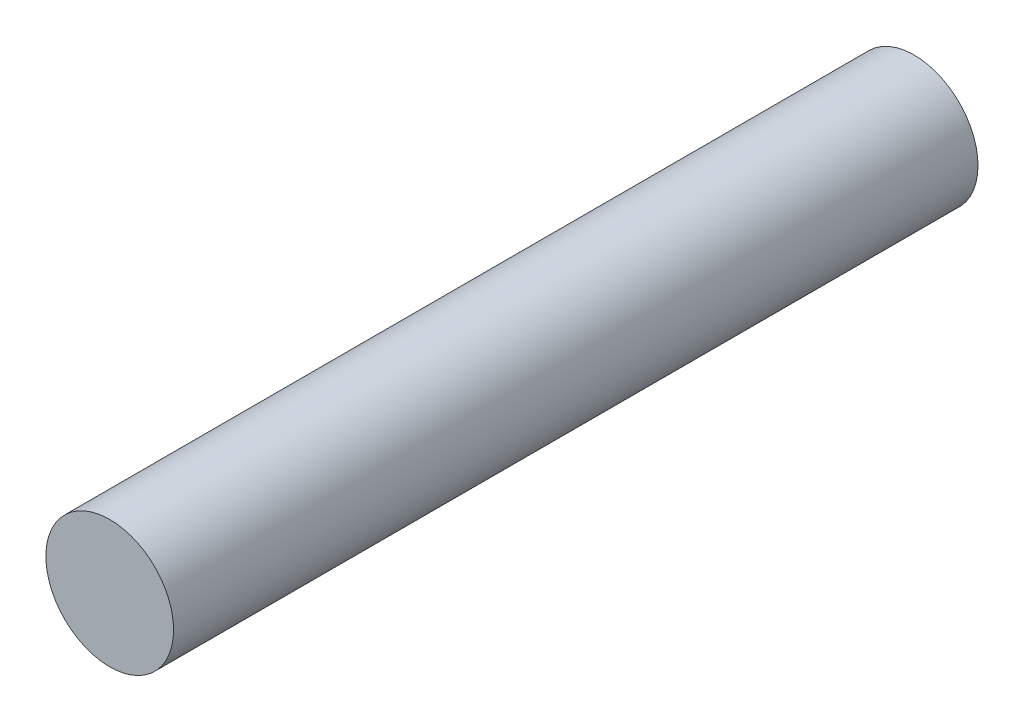
ISO-10303-21;
HEADER;
FILE_DESCRIPTION(('STEP AP214'),'2;1');
FILE_NAME('part.step','',(''),(''),'','','');
FILE_SCHEMA(('AUTOMOTIVE_DESIGN { 1 0 10303 214 1 1 1 1 }'));
ENDSEC;
DATA;
#1=APPLICATION_CONTEXT('core data for automotive mechanical design processes');
#2=APPLICATION_PROTOCOL_DEFINITION('international standard','automotive_design',2000,#1);
#3=PRODUCT_CONTEXT('',#1,'mechanical');
#4=PRODUCT('Part','Part','',(#3));
#5=PRODUCT_RELATED_PRODUCT_CATEGORY('part','',(#4));
#6=PRODUCT_DEFINITION_FORMATION('','',#4);
#7=PRODUCT_DEFINITION_CONTEXT('part definition',#1,'design');
#8=PRODUCT_DEFINITION('design','',#6,#7);
#9=PRODUCT_DEFINITION_SHAPE('','',#8);
#10=(LENGTH_UNIT() NAMED_UNIT(*) SI_UNIT(.MILLI.,.METRE.));
#11=(NAMED_UNIT(*) PLANE_ANGLE_UNIT() SI_UNIT($,.RADIAN.));
#12=(NAMED_UNIT(*) SI_UNIT($,.STERADIAN.) SOLID_ANGLE_UNIT());
#13=UNCERTAINTY_MEASURE_WITH_UNIT(LENGTH_MEASURE(1.E-05),#10,'distance_accuracy_value','');
#14=(GEOMETRIC_REPRESENTATION_CONTEXT(3) GLOBAL_UNCERTAINTY_ASSIGNED_CONTEXT((#13)) GLOBAL_UNIT_ASSIGNED_CONTEXT((#10,
#11,#12)) REPRESENTATION_CONTEXT('',''));
#15=CARTESIAN_POINT('',(0.,0.,0.));
#16=DIRECTION('',(0.,0.,1.));
#17=DIRECTION('',(1.,0.,0.));
#18=AXIS2_PLACEMENT_3D('',#15,#16,#17);
#19=CARTESIAN_POINT('',(0.,0.,20.));
#20=DIRECTION('',(0.,0.,-1.));
#21=DIRECTION('',(-1.,0.,0.));
#22=AXIS2_PLACEMENT_3D('',#19,#20,#21);
#23=CYLINDRICAL_SURFACE('',#22,1.5875);
#24=CARTESIAN_POINT('',(0.,0.,20.));
#25=DIRECTION('',(0.,0.,1.));
#26=DIRECTION('',(1.,0.,0.));
#27=AXIS2_PLACEMENT_3D('',#24,#25,#26);
#28=CIRCLE('',#27,1.5875);
#29=CARTESIAN_POINT('',(1.5875,0.,20.));
#30=VERTEX_POINT('',#29);
#31=EDGE_CURVE('E10',#30,#30,#28,.T.);
#32=ORIENTED_EDGE('',*,*,#31,.F.);
#33=EDGE_LOOP('',(#32));
#34=FACE_BOUND('',#33,.T.);
#35=CARTESIAN_POINT('',(0.,0.,0.));
#36=DIRECTION('',(0.,0.,1.));
#37=DIRECTION('',(1.,0.,0.));
#38=AXIS2_PLACEMENT_3D('',#35,#36,#37);
#39=CIRCLE('',#38,1.5875);
#40=CARTESIAN_POINT('',(1.5875,0.,0.));
#41=VERTEX_POINT('',#40);
#42=EDGE_CURVE('E34',#41,#41,#39,.T.);
#43=ORIENTED_EDGE('',*,*,#42,.T.);
#44=EDGE_LOOP('',(#43));
#45=FACE_BOUND('',#44,.T.);
#46=ADVANCED_FACE('F31',(#34,#45),#23,.T.);
#47=CARTESIAN_POINT('',(0.,0.,20.));
#48=DIRECTION('',(0.,0.,1.));
#49=DIRECTION('',(1.,0.,0.));
#50=AXIS2_PLACEMENT_3D('',#47,#48,#49);
#51=PLANE('',#50);
#52=ORIENTED_EDGE('',*,*,#31,.T.);
#53=EDGE_LOOP('',(#52));
#54=FACE_BOUND('',#53,.T.);
#55=ADVANCED_FACE('F46',(#54),#51,.T.);
#56=CARTESIAN_POINT('',(0.,0.,0.));
#57=DIRECTION('',(0.,0.,1.));
#58=DIRECTION('',(1.,0.,0.));
#59=AXIS2_PLACEMENT_3D('',#56,#57,#58);
#60=PLANE('',#59);
#61=ORIENTED_EDGE('',*,*,#42,.F.);
#62=EDGE_LOOP('',(#61));
#63=FACE_BOUND('',#62,.T.);
#64=ADVANCED_FACE('F44',(#63),#60,.F.);
#65=CLOSED_SHELL('',(#46,#55,#64));
#66=MANIFOLD_SOLID_BREP('B2',#65);
#67=ADVANCED_BREP_SHAPE_REPRESENTATION('',(#18,#66),#14);
#68=SHAPE_DEFINITION_REPRESENTATION(#9,#67);
ENDSEC;
END-ISO-10303-21;
